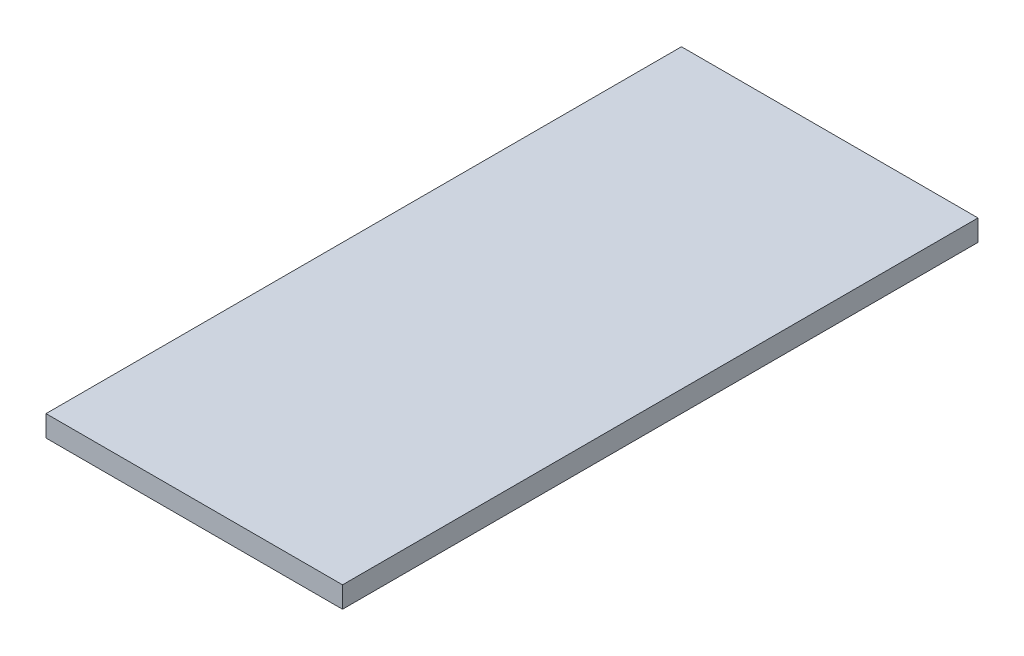
ISO-10303-21;
HEADER;
FILE_DESCRIPTION(('STEP AP214'),'2;1');
FILE_NAME('part.step','',(''),(''),'','','');
FILE_SCHEMA(('AUTOMOTIVE_DESIGN { 1 0 10303 214 1 1 1 1 }'));
ENDSEC;
DATA;
#1=APPLICATION_CONTEXT('core data for automotive mechanical design processes');
#2=APPLICATION_PROTOCOL_DEFINITION('international standard','automotive_design',2000,#1);
#3=PRODUCT_CONTEXT('',#1,'mechanical');
#4=PRODUCT('Part','Part','',(#3));
#5=PRODUCT_RELATED_PRODUCT_CATEGORY('part','',(#4));
#6=PRODUCT_DEFINITION_FORMATION('','',#4);
#7=PRODUCT_DEFINITION_CONTEXT('part definition',#1,'design');
#8=PRODUCT_DEFINITION('design','',#6,#7);
#9=PRODUCT_DEFINITION_SHAPE('','',#8);
#10=(LENGTH_UNIT() NAMED_UNIT(*) SI_UNIT(.MILLI.,.METRE.));
#11=(NAMED_UNIT(*) PLANE_ANGLE_UNIT() SI_UNIT($,.RADIAN.));
#12=(NAMED_UNIT(*) SI_UNIT($,.STERADIAN.) SOLID_ANGLE_UNIT());
#13=UNCERTAINTY_MEASURE_WITH_UNIT(LENGTH_MEASURE(1.E-05),#10,'distance_accuracy_value','');
#14=(GEOMETRIC_REPRESENTATION_CONTEXT(3) GLOBAL_UNCERTAINTY_ASSIGNED_CONTEXT((#13)) GLOBAL_UNIT_ASSIGNED_CONTEXT((#10,
#11,#12)) REPRESENTATION_CONTEXT('',''));
#15=CARTESIAN_POINT('',(0.,0.,0.));
#16=DIRECTION('',(0.,0.,1.));
#17=DIRECTION('',(1.,0.,0.));
#18=AXIS2_PLACEMENT_3D('',#15,#16,#17);
#19=CARTESIAN_POINT('',(-43.0167597765363,5.,-35.));
#20=DIRECTION('',(1.,0.,0.));
#21=DIRECTION('',(0.,0.,-1.));
#22=AXIS2_PLACEMENT_3D('',#19,#20,#21);
#23=PLANE('',#22);
#24=DIRECTION('',(0.,0.,1.));
#25=VECTOR('',#24,1.);
#26=CARTESIAN_POINT('',(-43.0167597765363,0.,-35.));
#27=LINE('',#26,#25);
#28=CARTESIAN_POINT('',(-43.0167597765363,0.,-35.));
#29=VERTEX_POINT('',#28);
#30=CARTESIAN_POINT('',(-43.0167597765362,0.,115.));
#31=VERTEX_POINT('',#30);
#32=EDGE_CURVE('E95',#29,#31,#27,.T.);
#33=ORIENTED_EDGE('',*,*,#32,.T.);
#34=DIRECTION('',(0.,-1.,0.));
#35=VECTOR('',#34,1.);
#36=CARTESIAN_POINT('',(-43.0167597765362,5.,115.));
#37=LINE('',#36,#35);
#38=CARTESIAN_POINT('',(-43.0167597765362,5.,115.));
#39=VERTEX_POINT('',#38);
#40=EDGE_CURVE('E11',#39,#31,#37,.T.);
#41=ORIENTED_EDGE('',*,*,#40,.F.);
#42=DIRECTION('',(0.,0.,1.));
#43=VECTOR('',#42,1.);
#44=CARTESIAN_POINT('',(-43.0167597765363,5.,-35.));
#45=LINE('',#44,#43);
#46=CARTESIAN_POINT('',(-43.0167597765363,5.,-35.));
#47=VERTEX_POINT('',#46);
#48=EDGE_CURVE('E83',#47,#39,#45,.T.);
#49=ORIENTED_EDGE('',*,*,#48,.F.);
#50=DIRECTION('',(0.,-1.,0.));
#51=VECTOR('',#50,1.);
#52=CARTESIAN_POINT('',(-43.0167597765363,5.,-35.));
#53=LINE('',#52,#51);
#54=EDGE_CURVE('E91',#47,#29,#53,.T.);
#55=ORIENTED_EDGE('',*,*,#54,.T.);
#56=EDGE_LOOP('',(#33,#41,#49,#55));
#57=FACE_BOUND('',#56,.T.);
#58=ADVANCED_FACE('F32',(#57),#23,.F.);
#59=CARTESIAN_POINT('',(-43.0167597765362,5.,115.));
#60=DIRECTION('',(0.,0.,-1.));
#61=DIRECTION('',(-1.,0.,0.));
#62=AXIS2_PLACEMENT_3D('',#59,#60,#61);
#63=PLANE('',#62);
#64=DIRECTION('',(1.,0.,0.));
#65=VECTOR('',#64,1.);
#66=CARTESIAN_POINT('',(-43.0167597765362,0.,115.));
#67=LINE('',#66,#65);
#68=CARTESIAN_POINT('',(26.9832402234638,0.,115.));
#69=VERTEX_POINT('',#68);
#70=EDGE_CURVE('E87',#31,#69,#67,.T.);
#71=ORIENTED_EDGE('',*,*,#70,.T.);
#72=DIRECTION('',(0.,-1.,0.));
#73=VECTOR('',#72,1.);
#74=CARTESIAN_POINT('',(26.9832402234638,5.,115.));
#75=LINE('',#74,#73);
#76=CARTESIAN_POINT('',(26.9832402234638,5.,115.));
#77=VERTEX_POINT('',#76);
#78=EDGE_CURVE('E40',#77,#69,#75,.T.);
#79=ORIENTED_EDGE('',*,*,#78,.F.);
#80=DIRECTION('',(1.,0.,0.));
#81=VECTOR('',#80,1.);
#82=CARTESIAN_POINT('',(-43.0167597765362,5.,115.));
#83=LINE('',#82,#81);
#84=EDGE_CURVE('E78',#39,#77,#83,.T.);
#85=ORIENTED_EDGE('',*,*,#84,.F.);
#86=ORIENTED_EDGE('',*,*,#40,.T.);
#87=EDGE_LOOP('',(#71,#79,#85,#86));
#88=FACE_BOUND('',#87,.T.);
#89=ADVANCED_FACE('F86',(#88),#63,.F.);
#90=CARTESIAN_POINT('',(26.9832402234637,5.,-35.));
#91=DIRECTION('',(-1.,0.,0.));
#92=DIRECTION('',(0.,0.,1.));
#93=AXIS2_PLACEMENT_3D('',#90,#91,#92);
#94=PLANE('',#93);
#95=DIRECTION('',(0.,0.,-1.));
#96=VECTOR('',#95,1.);
#97=CARTESIAN_POINT('',(26.9832402234637,0.,-35.));
#98=LINE('',#97,#96);
#99=CARTESIAN_POINT('',(26.9832402234637,0.,-35.));
#100=VERTEX_POINT('',#99);
#101=EDGE_CURVE('E65',#69,#100,#98,.T.);
#102=ORIENTED_EDGE('',*,*,#101,.T.);
#103=DIRECTION('',(0.,-1.,0.));
#104=VECTOR('',#103,1.);
#105=CARTESIAN_POINT('',(26.9832402234637,5.,-35.));
#106=LINE('',#105,#104);
#107=CARTESIAN_POINT('',(26.9832402234637,5.,-35.));
#108=VERTEX_POINT('',#107);
#109=EDGE_CURVE('E88',#108,#100,#106,.T.);
#110=ORIENTED_EDGE('',*,*,#109,.F.);
#111=DIRECTION('',(0.,0.,-1.));
#112=VECTOR('',#111,1.);
#113=CARTESIAN_POINT('',(26.9832402234637,5.,-35.));
#114=LINE('',#113,#112);
#115=EDGE_CURVE('E81',#77,#108,#114,.T.);
#116=ORIENTED_EDGE('',*,*,#115,.F.);
#117=ORIENTED_EDGE('',*,*,#78,.T.);
#118=EDGE_LOOP('',(#102,#110,#116,#117));
#119=FACE_BOUND('',#118,.T.);
#120=ADVANCED_FACE('F89',(#119),#94,.F.);
#121=CARTESIAN_POINT('',(-43.0167597765363,5.,-35.));
#122=DIRECTION('',(0.,0.,1.));
#123=DIRECTION('',(1.,0.,0.));
#124=AXIS2_PLACEMENT_3D('',#121,#122,#123);
#125=PLANE('',#124);
#126=DIRECTION('',(-1.,0.,0.));
#127=VECTOR('',#126,1.);
#128=CARTESIAN_POINT('',(-43.0167597765363,0.,-35.));
#129=LINE('',#128,#127);
#130=EDGE_CURVE('E71',#100,#29,#129,.T.);
#131=ORIENTED_EDGE('',*,*,#130,.T.);
#132=ORIENTED_EDGE('',*,*,#54,.F.);
#133=DIRECTION('',(-1.,0.,0.));
#134=VECTOR('',#133,1.);
#135=CARTESIAN_POINT('',(-43.0167597765363,5.,-35.));
#136=LINE('',#135,#134);
#137=EDGE_CURVE('E48',#108,#47,#136,.T.);
#138=ORIENTED_EDGE('',*,*,#137,.F.);
#139=ORIENTED_EDGE('',*,*,#109,.T.);
#140=EDGE_LOOP('',(#131,#132,#138,#139));
#141=FACE_BOUND('',#140,.T.);
#142=ADVANCED_FACE('F102',(#141),#125,.F.);
#143=CARTESIAN_POINT('',(0.,5.,0.));
#144=DIRECTION('',(0.,1.,0.));
#145=DIRECTION('',(0.,0.,1.));
#146=AXIS2_PLACEMENT_3D('',#143,#144,#145);
#147=PLANE('',#146);
#148=ORIENTED_EDGE('',*,*,#48,.T.);
#149=ORIENTED_EDGE('',*,*,#84,.T.);
#150=ORIENTED_EDGE('',*,*,#115,.T.);
#151=ORIENTED_EDGE('',*,*,#137,.T.);
#152=EDGE_LOOP('',(#148,#149,#150,#151));
#153=FACE_BOUND('',#152,.T.);
#154=ADVANCED_FACE('F79',(#153),#147,.T.);
#155=CARTESIAN_POINT('',(0.,0.,0.));
#156=DIRECTION('',(0.,1.,0.));
#157=DIRECTION('',(0.,0.,1.));
#158=AXIS2_PLACEMENT_3D('',#155,#156,#157);
#159=PLANE('',#158);
#160=ORIENTED_EDGE('',*,*,#32,.F.);
#161=ORIENTED_EDGE('',*,*,#130,.F.);
#162=ORIENTED_EDGE('',*,*,#101,.F.);
#163=ORIENTED_EDGE('',*,*,#70,.F.);
#164=EDGE_LOOP('',(#160,#161,#162,#163));
#165=FACE_BOUND('',#164,.T.);
#166=ADVANCED_FACE('F105',(#165),#159,.F.);
#167=CLOSED_SHELL('',(#58,#89,#120,#142,#154,#166));
#168=MANIFOLD_SOLID_BREP('B2',#167);
#169=ADVANCED_BREP_SHAPE_REPRESENTATION('',(#18,#168),#14);
#170=SHAPE_DEFINITION_REPRESENTATION(#9,#169);
ENDSEC;
END-ISO-10303-21;
